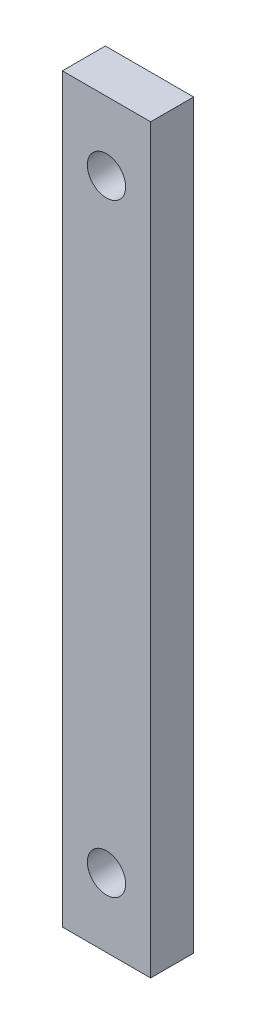
ISO-10303-21;
HEADER;
FILE_DESCRIPTION(('STEP AP214'),'2;1');
FILE_NAME('part.step','',(''),(''),'','','');
FILE_SCHEMA(('AUTOMOTIVE_DESIGN { 1 0 10303 214 1 1 1 1 }'));
ENDSEC;
DATA;
#1=APPLICATION_CONTEXT('core data for automotive mechanical design processes');
#2=APPLICATION_PROTOCOL_DEFINITION('international standard','automotive_design',2000,#1);
#3=PRODUCT_CONTEXT('',#1,'mechanical');
#4=PRODUCT('Part','Part','',(#3));
#5=PRODUCT_RELATED_PRODUCT_CATEGORY('part','',(#4));
#6=PRODUCT_DEFINITION_FORMATION('','',#4);
#7=PRODUCT_DEFINITION_CONTEXT('part definition',#1,'design');
#8=PRODUCT_DEFINITION('design','',#6,#7);
#9=PRODUCT_DEFINITION_SHAPE('','',#8);
#10=(LENGTH_UNIT() NAMED_UNIT(*) SI_UNIT(.MILLI.,.METRE.));
#11=(NAMED_UNIT(*) PLANE_ANGLE_UNIT() SI_UNIT($,.RADIAN.));
#12=(NAMED_UNIT(*) SI_UNIT($,.STERADIAN.) SOLID_ANGLE_UNIT());
#13=UNCERTAINTY_MEASURE_WITH_UNIT(LENGTH_MEASURE(1.E-05),#10,'distance_accuracy_value','');
#14=(GEOMETRIC_REPRESENTATION_CONTEXT(3) GLOBAL_UNCERTAINTY_ASSIGNED_CONTEXT((#13)) GLOBAL_UNIT_ASSIGNED_CONTEXT((#10,
#11,#12)) REPRESENTATION_CONTEXT('',''));
#15=CARTESIAN_POINT('',(0.,0.,0.));
#16=DIRECTION('',(0.,0.,1.));
#17=DIRECTION('',(1.,0.,0.));
#18=AXIS2_PLACEMENT_3D('',#15,#16,#17);
#19=CARTESIAN_POINT('',(3.26,27.385,3.175));
#20=DIRECTION('',(-1.,0.,0.));
#21=DIRECTION('',(0.,-1.,0.));
#22=AXIS2_PLACEMENT_3D('',#19,#20,#21);
#23=PLANE('',#22);
#24=DIRECTION('',(0.,1.,0.));
#25=VECTOR('',#24,1.);
#26=CARTESIAN_POINT('',(3.26,27.385,0.));
#27=LINE('',#26,#25);
#28=CARTESIAN_POINT('',(3.26,-27.385,0.));
#29=VERTEX_POINT('',#28);
#30=CARTESIAN_POINT('',(3.26,27.385,0.));
#31=VERTEX_POINT('',#30);
#32=EDGE_CURVE('E99',#29,#31,#27,.T.);
#33=ORIENTED_EDGE('',*,*,#32,.T.);
#34=DIRECTION('',(0.,0.,-1.));
#35=VECTOR('',#34,1.);
#36=CARTESIAN_POINT('',(3.26,27.385,3.175));
#37=LINE('',#36,#35);
#38=CARTESIAN_POINT('',(3.26,27.385,3.175));
#39=VERTEX_POINT('',#38);
#40=EDGE_CURVE('E11',#39,#31,#37,.T.);
#41=ORIENTED_EDGE('',*,*,#40,.F.);
#42=DIRECTION('',(0.,1.,0.));
#43=VECTOR('',#42,1.);
#44=CARTESIAN_POINT('',(3.26,27.385,3.175));
#45=LINE('',#44,#43);
#46=CARTESIAN_POINT('',(3.26,-27.385,3.175));
#47=VERTEX_POINT('',#46);
#48=EDGE_CURVE('E87',#47,#39,#45,.T.);
#49=ORIENTED_EDGE('',*,*,#48,.F.);
#50=DIRECTION('',(0.,0.,-1.));
#51=VECTOR('',#50,1.);
#52=CARTESIAN_POINT('',(3.26,-27.385,3.175));
#53=LINE('',#52,#51);
#54=EDGE_CURVE('E95',#47,#29,#53,.T.);
#55=ORIENTED_EDGE('',*,*,#54,.T.);
#56=EDGE_LOOP('',(#33,#41,#49,#55));
#57=FACE_BOUND('',#56,.T.);
#58=ADVANCED_FACE('F36',(#57),#23,.F.);
#59=CARTESIAN_POINT('',(-3.26,27.385,3.175));
#60=DIRECTION('',(0.,-1.,0.));
#61=DIRECTION('',(0.,0.,-1.));
#62=AXIS2_PLACEMENT_3D('',#59,#60,#61);
#63=PLANE('',#62);
#64=DIRECTION('',(-1.,0.,0.));
#65=VECTOR('',#64,1.);
#66=CARTESIAN_POINT('',(-3.26,27.385,0.));
#67=LINE('',#66,#65);
#68=CARTESIAN_POINT('',(-3.26,27.385,0.));
#69=VERTEX_POINT('',#68);
#70=EDGE_CURVE('E91',#31,#69,#67,.T.);
#71=ORIENTED_EDGE('',*,*,#70,.T.);
#72=DIRECTION('',(0.,0.,-1.));
#73=VECTOR('',#72,1.);
#74=CARTESIAN_POINT('',(-3.26,27.385,3.175));
#75=LINE('',#74,#73);
#76=CARTESIAN_POINT('',(-3.26,27.385,3.175));
#77=VERTEX_POINT('',#76);
#78=EDGE_CURVE('E44',#77,#69,#75,.T.);
#79=ORIENTED_EDGE('',*,*,#78,.F.);
#80=DIRECTION('',(-1.,0.,0.));
#81=VECTOR('',#80,1.);
#82=CARTESIAN_POINT('',(-3.26,27.385,3.175));
#83=LINE('',#82,#81);
#84=EDGE_CURVE('E82',#39,#77,#83,.T.);
#85=ORIENTED_EDGE('',*,*,#84,.F.);
#86=ORIENTED_EDGE('',*,*,#40,.T.);
#87=EDGE_LOOP('',(#71,#79,#85,#86));
#88=FACE_BOUND('',#87,.T.);
#89=ADVANCED_FACE('F90',(#88),#63,.F.);
#90=CARTESIAN_POINT('',(-3.26,27.385,3.175));
#91=DIRECTION('',(1.,0.,0.));
#92=DIRECTION('',(0.,1.,0.));
#93=AXIS2_PLACEMENT_3D('',#90,#91,#92);
#94=PLANE('',#93);
#95=DIRECTION('',(0.,-1.,0.));
#96=VECTOR('',#95,1.);
#97=CARTESIAN_POINT('',(-3.26,27.385,0.));
#98=LINE('',#97,#96);
#99=CARTESIAN_POINT('',(-3.26,-27.385,0.));
#100=VERTEX_POINT('',#99);
#101=EDGE_CURVE('E69',#69,#100,#98,.T.);
#102=ORIENTED_EDGE('',*,*,#101,.T.);
#103=DIRECTION('',(0.,0.,-1.));
#104=VECTOR('',#103,1.);
#105=CARTESIAN_POINT('',(-3.26,-27.385,3.175));
#106=LINE('',#105,#104);
#107=CARTESIAN_POINT('',(-3.26,-27.385,3.175));
#108=VERTEX_POINT('',#107);
#109=EDGE_CURVE('E92',#108,#100,#106,.T.);
#110=ORIENTED_EDGE('',*,*,#109,.F.);
#111=DIRECTION('',(0.,-1.,0.));
#112=VECTOR('',#111,1.);
#113=CARTESIAN_POINT('',(-3.26,27.385,3.175));
#114=LINE('',#113,#112);
#115=EDGE_CURVE('E85',#77,#108,#114,.T.);
#116=ORIENTED_EDGE('',*,*,#115,.F.);
#117=ORIENTED_EDGE('',*,*,#78,.T.);
#118=EDGE_LOOP('',(#102,#110,#116,#117));
#119=FACE_BOUND('',#118,.T.);
#120=ADVANCED_FACE('F93',(#119),#94,.F.);
#121=CARTESIAN_POINT('',(-3.26,-27.385,3.175));
#122=DIRECTION('',(0.,1.,0.));
#123=DIRECTION('',(0.,0.,1.));
#124=AXIS2_PLACEMENT_3D('',#121,#122,#123);
#125=PLANE('',#124);
#126=DIRECTION('',(1.,0.,0.));
#127=VECTOR('',#126,1.);
#128=CARTESIAN_POINT('',(-3.26,-27.385,0.));
#129=LINE('',#128,#127);
#130=EDGE_CURVE('E75',#100,#29,#129,.T.);
#131=ORIENTED_EDGE('',*,*,#130,.T.);
#132=ORIENTED_EDGE('',*,*,#54,.F.);
#133=DIRECTION('',(1.,0.,0.));
#134=VECTOR('',#133,1.);
#135=CARTESIAN_POINT('',(-3.26,-27.385,3.175));
#136=LINE('',#135,#134);
#137=EDGE_CURVE('E52',#108,#47,#136,.T.);
#138=ORIENTED_EDGE('',*,*,#137,.F.);
#139=ORIENTED_EDGE('',*,*,#109,.T.);
#140=EDGE_LOOP('',(#131,#132,#138,#139));
#141=FACE_BOUND('',#140,.T.);
#142=ADVANCED_FACE('F107',(#141),#125,.F.);
#143=CARTESIAN_POINT('',(0.,0.,3.175));
#144=DIRECTION('',(0.,0.,1.));
#145=DIRECTION('',(1.,0.,0.));
#146=AXIS2_PLACEMENT_3D('',#143,#144,#145);
#147=PLANE('',#146);
#148=CARTESIAN_POINT('',(0.,22.295,3.175));
#149=DIRECTION('',(0.,0.,1.));
#150=DIRECTION('',(1.,0.,0.));
#151=AXIS2_PLACEMENT_3D('',#148,#149,#150);
#152=CIRCLE('',#151,1.415);
#153=CARTESIAN_POINT('',(1.415,22.295,3.175));
#154=VERTEX_POINT('',#153);
#155=EDGE_CURVE('E119',#154,#154,#152,.T.);
#156=ORIENTED_EDGE('',*,*,#155,.F.);
#157=EDGE_LOOP('',(#156));
#158=FACE_BOUND('',#157,.T.);
#159=CARTESIAN_POINT('',(0.,-22.295,3.175));
#160=DIRECTION('',(0.,0.,1.));
#161=DIRECTION('',(-1.,0.,0.));
#162=AXIS2_PLACEMENT_3D('',#159,#160,#161);
#163=CIRCLE('',#162,1.415);
#164=CARTESIAN_POINT('',(-1.415,-22.295,3.175));
#165=VERTEX_POINT('',#164);
#166=EDGE_CURVE('E113',#165,#165,#163,.T.);
#167=ORIENTED_EDGE('',*,*,#166,.F.);
#168=EDGE_LOOP('',(#167));
#169=FACE_BOUND('',#168,.T.);
#170=ORIENTED_EDGE('',*,*,#48,.T.);
#171=ORIENTED_EDGE('',*,*,#84,.T.);
#172=ORIENTED_EDGE('',*,*,#115,.T.);
#173=ORIENTED_EDGE('',*,*,#137,.T.);
#174=EDGE_LOOP('',(#170,#171,#172,#173));
#175=FACE_BOUND('',#174,.T.);
#176=ADVANCED_FACE('F83',(#158,#169,#175),#147,.T.);
#177=CARTESIAN_POINT('',(0.,0.,0.));
#178=DIRECTION('',(0.,0.,1.));
#179=DIRECTION('',(1.,0.,0.));
#180=AXIS2_PLACEMENT_3D('',#177,#178,#179);
#181=PLANE('',#180);
#182=CARTESIAN_POINT('',(0.,22.295,0.));
#183=DIRECTION('',(0.,0.,1.));
#184=DIRECTION('',(1.,0.,0.));
#185=AXIS2_PLACEMENT_3D('',#182,#183,#184);
#186=CIRCLE('',#185,1.415);
#187=CARTESIAN_POINT('',(1.415,22.295,0.));
#188=VERTEX_POINT('',#187);
#189=EDGE_CURVE('E102',#188,#188,#186,.T.);
#190=ORIENTED_EDGE('',*,*,#189,.T.);
#191=EDGE_LOOP('',(#190));
#192=FACE_BOUND('',#191,.T.);
#193=CARTESIAN_POINT('',(0.,-22.295,0.));
#194=DIRECTION('',(0.,0.,1.));
#195=DIRECTION('',(-1.,0.,0.));
#196=AXIS2_PLACEMENT_3D('',#193,#194,#195);
#197=CIRCLE('',#196,1.415);
#198=CARTESIAN_POINT('',(-1.415,-22.295,0.));
#199=VERTEX_POINT('',#198);
#200=EDGE_CURVE('E116',#199,#199,#197,.T.);
#201=ORIENTED_EDGE('',*,*,#200,.T.);
#202=EDGE_LOOP('',(#201));
#203=FACE_BOUND('',#202,.T.);
#204=ORIENTED_EDGE('',*,*,#32,.F.);
#205=ORIENTED_EDGE('',*,*,#130,.F.);
#206=ORIENTED_EDGE('',*,*,#101,.F.);
#207=ORIENTED_EDGE('',*,*,#70,.F.);
#208=EDGE_LOOP('',(#204,#205,#206,#207));
#209=FACE_BOUND('',#208,.T.);
#210=ADVANCED_FACE('F110',(#192,#203,#209),#181,.F.);
#211=CARTESIAN_POINT('',(0.,-22.295,0.));
#212=DIRECTION('',(0.,0.,1.));
#213=DIRECTION('',(1.,0.,0.));
#214=AXIS2_PLACEMENT_3D('',#211,#212,#213);
#215=CYLINDRICAL_SURFACE('',#214,1.415);
#216=ORIENTED_EDGE('',*,*,#200,.F.);
#217=EDGE_LOOP('',(#216));
#218=FACE_BOUND('',#217,.T.);
#219=ORIENTED_EDGE('',*,*,#166,.T.);
#220=EDGE_LOOP('',(#219));
#221=FACE_BOUND('',#220,.T.);
#222=ADVANCED_FACE('F130',(#218,#221),#215,.F.);
#223=CARTESIAN_POINT('',(0.,22.295,0.));
#224=DIRECTION('',(0.,0.,1.));
#225=DIRECTION('',(1.,0.,0.));
#226=AXIS2_PLACEMENT_3D('',#223,#224,#225);
#227=CYLINDRICAL_SURFACE('',#226,1.415);
#228=ORIENTED_EDGE('',*,*,#189,.F.);
#229=EDGE_LOOP('',(#228));
#230=FACE_BOUND('',#229,.T.);
#231=ORIENTED_EDGE('',*,*,#155,.T.);
#232=EDGE_LOOP('',(#231));
#233=FACE_BOUND('',#232,.T.);
#234=ADVANCED_FACE('F127',(#230,#233),#227,.F.);
#235=CLOSED_SHELL('',(#58,#89,#120,#142,#176,#210,#222,#234));
#236=MANIFOLD_SOLID_BREP('B2',#235);
#237=ADVANCED_BREP_SHAPE_REPRESENTATION('',(#18,#236),#14);
#238=SHAPE_DEFINITION_REPRESENTATION(#9,#237);
ENDSEC;
END-ISO-10303-21;
